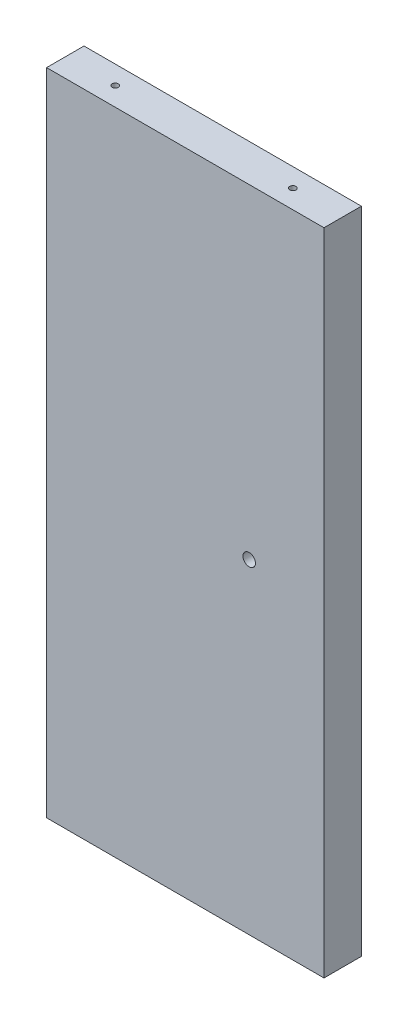
ISO-10303-21;
HEADER;
FILE_DESCRIPTION(('STEP AP214'),'2;1');
FILE_NAME('part.step','',(''),(''),'','','');
FILE_SCHEMA(('AUTOMOTIVE_DESIGN { 1 0 10303 214 1 1 1 1 }'));
ENDSEC;
DATA;
#1=APPLICATION_CONTEXT('core data for automotive mechanical design processes');
#2=APPLICATION_PROTOCOL_DEFINITION('international standard','automotive_design',2000,#1);
#3=PRODUCT_CONTEXT('',#1,'mechanical');
#4=PRODUCT('Part','Part','',(#3));
#5=PRODUCT_RELATED_PRODUCT_CATEGORY('part','',(#4));
#6=PRODUCT_DEFINITION_FORMATION('','',#4);
#7=PRODUCT_DEFINITION_CONTEXT('part definition',#1,'design');
#8=PRODUCT_DEFINITION('design','',#6,#7);
#9=PRODUCT_DEFINITION_SHAPE('','',#8);
#10=(LENGTH_UNIT() NAMED_UNIT(*) SI_UNIT(.MILLI.,.METRE.));
#11=(NAMED_UNIT(*) PLANE_ANGLE_UNIT() SI_UNIT($,.RADIAN.));
#12=(NAMED_UNIT(*) SI_UNIT($,.STERADIAN.) SOLID_ANGLE_UNIT());
#13=UNCERTAINTY_MEASURE_WITH_UNIT(LENGTH_MEASURE(1.E-05),#10,'distance_accuracy_value','');
#14=(GEOMETRIC_REPRESENTATION_CONTEXT(3) GLOBAL_UNCERTAINTY_ASSIGNED_CONTEXT((#13)) GLOBAL_UNIT_ASSIGNED_CONTEXT((#10,
#11,#12)) REPRESENTATION_CONTEXT('',''));
#15=CARTESIAN_POINT('',(0.,0.,0.));
#16=DIRECTION('',(0.,0.,1.));
#17=DIRECTION('',(1.,0.,0.));
#18=AXIS2_PLACEMENT_3D('',#15,#16,#17);
#19=CARTESIAN_POINT('',(209.352967180639,93.4499999969914,19.0499999999996));
#20=DIRECTION('',(1.,0.,0.));
#21=DIRECTION('',(0.,1.,0.));
#22=AXIS2_PLACEMENT_3D('',#19,#20,#21);
#23=PLANE('',#22);
#24=CARTESIAN_POINT('',(209.352967180642,-72.0249999970058,9.52500000000056));
#25=DIRECTION('',(1.,0.,0.));
#26=DIRECTION('',(0.,1.,0.));
#27=AXIS2_PLACEMENT_3D('',#24,#25,#26);
#28=CIRCLE('',#27,1.5875);
#29=CARTESIAN_POINT('',(209.352967180642,-70.4374999970058,9.52500000000056));
#30=VERTEX_POINT('',#29);
#31=EDGE_CURVE('E126',#30,#30,#28,.T.);
#32=ORIENTED_EDGE('',*,*,#31,.T.);
#33=EDGE_LOOP('',(#32));
#34=FACE_BOUND('',#33,.T.);
#35=CARTESIAN_POINT('',(209.352967180643,-154.762499994009,9.5249999999999));
#36=DIRECTION('',(1.,0.,0.));
#37=DIRECTION('',(0.,1.,0.));
#38=AXIS2_PLACEMENT_3D('',#35,#36,#37);
#39=CIRCLE('',#38,1.58749999999999);
#40=CARTESIAN_POINT('',(209.352967180643,-153.174999994009,9.5249999999999));
#41=VERTEX_POINT('',#40);
#42=EDGE_CURVE('E130',#41,#41,#39,.T.);
#43=ORIENTED_EDGE('',*,*,#42,.T.);
#44=EDGE_LOOP('',(#43));
#45=FACE_BOUND('',#44,.T.);
#46=CARTESIAN_POINT('',(209.352967180642,10.7124999999833,9.52500000000145));
#47=DIRECTION('',(1.,0.,0.));
#48=DIRECTION('',(0.,1.,0.));
#49=AXIS2_PLACEMENT_3D('',#46,#47,#48);
#50=CIRCLE('',#49,1.5875);
#51=CARTESIAN_POINT('',(209.352967180642,12.2999999999833,9.52500000000145));
#52=VERTEX_POINT('',#51);
#53=EDGE_CURVE('E134',#52,#52,#50,.T.);
#54=ORIENTED_EDGE('',*,*,#53,.T.);
#55=EDGE_LOOP('',(#54));
#56=FACE_BOUND('',#55,.T.);
#57=DIRECTION('',(0.,-1.,0.));
#58=VECTOR('',#57,1.);
#59=CARTESIAN_POINT('',(209.352967180639,93.4499999969935,-1.11022302462516E-13));
#60=LINE('',#59,#58);
#61=CARTESIAN_POINT('',(209.352967180639,93.4499999969935,-1.11022302462516E-13));
#62=VERTEX_POINT('',#61);
#63=CARTESIAN_POINT('',(209.352967180646,-237.499999991006,1.4432899320127E-12));
#64=VERTEX_POINT('',#63);
#65=EDGE_CURVE('E142',#62,#64,#60,.T.);
#66=ORIENTED_EDGE('',*,*,#65,.T.);
#67=DIRECTION('',(0.,0.,-1.));
#68=VECTOR('',#67,1.);
#69=CARTESIAN_POINT('',(209.352967180647,-237.499999991008,19.0500000000026));
#70=LINE('',#69,#68);
#71=CARTESIAN_POINT('',(209.352967180647,-237.499999991008,19.0500000000026));
#72=VERTEX_POINT('',#71);
#73=EDGE_CURVE('E11',#72,#64,#70,.T.);
#74=ORIENTED_EDGE('',*,*,#73,.F.);
#75=DIRECTION('',(0.,-1.,0.));
#76=VECTOR('',#75,1.);
#77=CARTESIAN_POINT('',(209.352967180639,93.4499999969914,19.0499999999996));
#78=LINE('',#77,#76);
#79=CARTESIAN_POINT('',(209.352967180639,93.4499999969914,19.0499999999996));
#80=VERTEX_POINT('',#79);
#81=EDGE_CURVE('E135',#80,#72,#78,.T.);
#82=ORIENTED_EDGE('',*,*,#81,.F.);
#83=DIRECTION('',(0.,0.,-1.));
#84=VECTOR('',#83,1.);
#85=CARTESIAN_POINT('',(209.352967180639,93.4499999969914,19.0499999999996));
#86=LINE('',#85,#84);
#87=EDGE_CURVE('E141',#80,#62,#86,.T.);
#88=ORIENTED_EDGE('',*,*,#87,.T.);
#89=EDGE_LOOP('',(#66,#74,#82,#88));
#90=FACE_BOUND('',#89,.T.);
#91=ADVANCED_FACE('F36',(#34,#45,#56,#90),#23,.F.);
#92=CARTESIAN_POINT('',(209.352967180647,-237.499999991008,19.0500000000026));
#93=DIRECTION('',(0.,1.,0.));
#94=DIRECTION('',(0.,0.,1.));
#95=AXIS2_PLACEMENT_3D('',#92,#93,#94);
#96=PLANE('',#95);
#97=DIRECTION('',(1.,0.,0.));
#98=VECTOR('',#97,1.);
#99=CARTESIAN_POINT('',(209.352967180646,-237.499999991006,1.4432899320127E-12));
#100=LINE('',#99,#98);
#101=CARTESIAN_POINT('',(350.640829294267,-237.499999991006,2.1094237467878E-12));
#102=VERTEX_POINT('',#101);
#103=EDGE_CURVE('E145',#64,#102,#100,.T.);
#104=ORIENTED_EDGE('',*,*,#103,.T.);
#105=DIRECTION('',(0.,0.,-1.));
#106=VECTOR('',#105,1.);
#107=CARTESIAN_POINT('',(350.640829294267,-237.499999991007,19.0500000000026));
#108=LINE('',#107,#106);
#109=CARTESIAN_POINT('',(350.640829294267,-237.499999991007,19.0500000000026));
#110=VERTEX_POINT('',#109);
#111=EDGE_CURVE('E45',#110,#102,#108,.T.);
#112=ORIENTED_EDGE('',*,*,#111,.F.);
#113=DIRECTION('',(1.,0.,0.));
#114=VECTOR('',#113,1.);
#115=CARTESIAN_POINT('',(209.352967180647,-237.499999991008,19.0500000000026));
#116=LINE('',#115,#114);
#117=EDGE_CURVE('E85',#72,#110,#116,.T.);
#118=ORIENTED_EDGE('',*,*,#117,.F.);
#119=ORIENTED_EDGE('',*,*,#73,.T.);
#120=EDGE_LOOP('',(#104,#112,#118,#119));
#121=FACE_BOUND('',#120,.T.);
#122=ADVANCED_FACE('F180',(#121),#96,.F.);
#123=CARTESIAN_POINT('',(350.640829294266,93.4499999969923,19.0499999999999));
#124=DIRECTION('',(-0.999999999999998,0.,0.));
#125=DIRECTION('',(0.,-1.,0.));
#126=AXIS2_PLACEMENT_3D('',#123,#124,#125);
#127=PLANE('',#126);
#128=DIRECTION('',(0.,1.,0.));
#129=VECTOR('',#128,1.);
#130=CARTESIAN_POINT('',(350.640829294267,93.4499999969934,-5.55111512312578E-13));
#131=LINE('',#130,#129);
#132=CARTESIAN_POINT('',(350.640829294267,93.4499999969934,-5.55111512312578E-13));
#133=VERTEX_POINT('',#132);
#134=EDGE_CURVE('E72',#102,#133,#131,.T.);
#135=ORIENTED_EDGE('',*,*,#134,.T.);
#136=DIRECTION('',(0.,0.,-1.));
#137=VECTOR('',#136,1.);
#138=CARTESIAN_POINT('',(350.640829294266,93.4499999969923,19.0499999999999));
#139=LINE('',#138,#137);
#140=CARTESIAN_POINT('',(350.640829294266,93.4499999969923,19.0499999999999));
#141=VERTEX_POINT('',#140);
#142=EDGE_CURVE('E150',#141,#133,#139,.T.);
#143=ORIENTED_EDGE('',*,*,#142,.F.);
#144=DIRECTION('',(0.,1.,0.));
#145=VECTOR('',#144,1.);
#146=CARTESIAN_POINT('',(350.640829294266,93.4499999969923,19.0499999999999));
#147=LINE('',#146,#145);
#148=EDGE_CURVE('E138',#110,#141,#147,.T.);
#149=ORIENTED_EDGE('',*,*,#148,.F.);
#150=ORIENTED_EDGE('',*,*,#111,.T.);
#151=EDGE_LOOP('',(#135,#143,#149,#150));
#152=FACE_BOUND('',#151,.T.);
#153=ADVANCED_FACE('F185',(#152),#127,.F.);
#154=CARTESIAN_POINT('',(209.352967180639,93.4499999969914,19.0499999999996));
#155=DIRECTION('',(0.,-1.,0.));
#156=DIRECTION('',(0.,0.,-1.));
#157=AXIS2_PLACEMENT_3D('',#154,#155,#156);
#158=PLANE('',#157);
#159=CARTESIAN_POINT('',(325.240829294253,93.4499999969935,9.52499999999967));
#160=DIRECTION('',(0.,-1.,0.));
#161=DIRECTION('',(0.,0.,-1.));
#162=AXIS2_PLACEMENT_3D('',#159,#160,#161);
#163=CIRCLE('',#162,1.58750000000002);
#164=CARTESIAN_POINT('',(325.240829294253,93.4499999969935,7.93749999999965));
#165=VERTEX_POINT('',#164);
#166=EDGE_CURVE('E39',#165,#165,#163,.T.);
#167=ORIENTED_EDGE('',*,*,#166,.T.);
#168=EDGE_LOOP('',(#167));
#169=FACE_BOUND('',#168,.T.);
#170=CARTESIAN_POINT('',(234.752967180639,93.4499999969935,9.5249999999999));
#171=DIRECTION('',(0.,-1.,0.));
#172=DIRECTION('',(0.,0.,-1.));
#173=AXIS2_PLACEMENT_3D('',#170,#171,#172);
#174=CIRCLE('',#173,1.58749999999999);
#175=CARTESIAN_POINT('',(234.752967180639,93.4499999969935,7.9374999999999));
#176=VERTEX_POINT('',#175);
#177=EDGE_CURVE('E122',#176,#176,#174,.T.);
#178=ORIENTED_EDGE('',*,*,#177,.T.);
#179=EDGE_LOOP('',(#178));
#180=FACE_BOUND('',#179,.T.);
#181=DIRECTION('',(-1.,0.,0.));
#182=VECTOR('',#181,1.);
#183=CARTESIAN_POINT('',(209.352967180639,93.4499999969935,-1.11022302462516E-13));
#184=LINE('',#183,#182);
#185=EDGE_CURVE('E78',#133,#62,#184,.T.);
#186=ORIENTED_EDGE('',*,*,#185,.T.);
#187=ORIENTED_EDGE('',*,*,#87,.F.);
#188=DIRECTION('',(-1.,0.,0.));
#189=VECTOR('',#188,1.);
#190=CARTESIAN_POINT('',(209.352967180639,93.4499999969914,19.0499999999996));
#191=LINE('',#190,#189);
#192=EDGE_CURVE('E54',#141,#80,#191,.T.);
#193=ORIENTED_EDGE('',*,*,#192,.F.);
#194=ORIENTED_EDGE('',*,*,#142,.T.);
#195=EDGE_LOOP('',(#186,#187,#193,#194));
#196=FACE_BOUND('',#195,.T.);
#197=ADVANCED_FACE('F161',(#169,#180,#196),#158,.F.);
#198=CARTESIAN_POINT('',(0.,-5.41233724504764E-13,19.0500000000001));
#199=DIRECTION('',(0.,0.,1.));
#200=DIRECTION('',(1.,0.,0.));
#201=AXIS2_PLACEMENT_3D('',#198,#199,#200);
#202=PLANE('',#201);
#203=CARTESIAN_POINT('',(312.540829294264,-72.0249999970022,19.0499999999999));
#204=DIRECTION('',(0.,0.,-1.));
#205=DIRECTION('',(-1.,0.,0.));
#206=AXIS2_PLACEMENT_3D('',#203,#204,#205);
#207=CIRCLE('',#206,3.17499999999993);
#208=CARTESIAN_POINT('',(309.365829294264,-72.0249999970022,19.0499999999999));
#209=VERTEX_POINT('',#208);
#210=EDGE_CURVE('E111',#209,#209,#207,.T.);
#211=ORIENTED_EDGE('',*,*,#210,.T.);
#212=EDGE_LOOP('',(#211));
#213=FACE_BOUND('',#212,.T.);
#214=ORIENTED_EDGE('',*,*,#81,.T.);
#215=ORIENTED_EDGE('',*,*,#117,.T.);
#216=ORIENTED_EDGE('',*,*,#148,.T.);
#217=ORIENTED_EDGE('',*,*,#192,.T.);
#218=EDGE_LOOP('',(#214,#215,#216,#217));
#219=FACE_BOUND('',#218,.T.);
#220=ADVANCED_FACE('F198',(#213,#219),#202,.T.);
#221=CARTESIAN_POINT('',(0.,0.,0.));
#222=DIRECTION('',(0.,0.,1.));
#223=DIRECTION('',(1.,0.,0.));
#224=AXIS2_PLACEMENT_3D('',#221,#222,#223);
#225=PLANE('',#224);
#226=CARTESIAN_POINT('',(312.540829294265,-72.0249999970018,-1.11022302462516E-13));
#227=DIRECTION('',(0.,0.,-1.));
#228=DIRECTION('',(-1.,0.,0.));
#229=AXIS2_PLACEMENT_3D('',#226,#227,#228);
#230=CIRCLE('',#229,3.17499999999993);
#231=CARTESIAN_POINT('',(309.365829294265,-72.0249999970018,-1.08378583885127E-13));
#232=VERTEX_POINT('',#231);
#233=EDGE_CURVE('E116',#232,#232,#230,.T.);
#234=ORIENTED_EDGE('',*,*,#233,.F.);
#235=EDGE_LOOP('',(#234));
#236=FACE_BOUND('',#235,.T.);
#237=ORIENTED_EDGE('',*,*,#65,.F.);
#238=ORIENTED_EDGE('',*,*,#185,.F.);
#239=ORIENTED_EDGE('',*,*,#134,.F.);
#240=ORIENTED_EDGE('',*,*,#103,.F.);
#241=EDGE_LOOP('',(#237,#238,#239,#240));
#242=FACE_BOUND('',#241,.T.);
#243=ADVANCED_FACE('F196',(#236,#242),#225,.F.);
#244=CARTESIAN_POINT('',(196.652967180634,10.7124999999829,9.52500000000012));
#245=DIRECTION('',(-1.,0.,0.));
#246=DIRECTION('',(0.,0.,1.));
#247=AXIS2_PLACEMENT_3D('',#244,#245,#246);
#248=CYLINDRICAL_SURFACE('',#247,1.5875);
#249=CARTESIAN_POINT('',(228.402967180635,10.7124999999828,9.52500000000056));
#250=DIRECTION('',(-1.,0.,0.));
#251=DIRECTION('',(0.,0.,1.));
#252=AXIS2_PLACEMENT_3D('',#249,#250,#251);
#253=CIRCLE('',#252,1.5875);
#254=CARTESIAN_POINT('',(228.402967180635,10.7124999999828,11.1125000000006));
#255=VERTEX_POINT('',#254);
#256=EDGE_CURVE('E131',#255,#255,#253,.T.);
#257=ORIENTED_EDGE('',*,*,#256,.F.);
#258=EDGE_LOOP('',(#257));
#259=FACE_BOUND('',#258,.T.);
#260=ORIENTED_EDGE('',*,*,#53,.F.);
#261=EDGE_LOOP('',(#260));
#262=FACE_BOUND('',#261,.T.);
#263=ADVANCED_FACE('F206',(#259,#262),#248,.F.);
#264=CARTESIAN_POINT('',(228.402967180635,10.7124999999828,9.52500000000056));
#265=DIRECTION('',(-1.,0.,0.));
#266=DIRECTION('',(0.,0.,1.));
#267=AXIS2_PLACEMENT_3D('',#264,#265,#266);
#268=CONICAL_SURFACE('',#267,1.5875,1.02974425867666);
#269=CARTESIAN_POINT('',(229.356833413341,10.7124999999828,9.52500000000178));
#270=VERTEX_POINT('',#269);
#271=VERTEX_LOOP('',#270);
#272=FACE_BOUND('',#271,.T.);
#273=ORIENTED_EDGE('',*,*,#256,.T.);
#274=EDGE_LOOP('',(#273));
#275=FACE_BOUND('',#274,.T.);
#276=ADVANCED_FACE('F212',(#272,#275),#268,.F.);
#277=CARTESIAN_POINT('',(196.652967180635,-154.762499994009,9.5249999999999));
#278=DIRECTION('',(-1.,0.,0.));
#279=DIRECTION('',(0.,0.,1.));
#280=AXIS2_PLACEMENT_3D('',#277,#278,#279);
#281=CYLINDRICAL_SURFACE('',#280,1.58749999999999);
#282=CARTESIAN_POINT('',(228.402967180636,-154.762499994009,9.52499999999878));
#283=DIRECTION('',(-1.,0.,0.));
#284=DIRECTION('',(0.,0.,1.));
#285=AXIS2_PLACEMENT_3D('',#282,#283,#284);
#286=CIRCLE('',#285,1.58749999999999);
#287=CARTESIAN_POINT('',(228.402967180636,-154.762499994009,11.1124999999988));
#288=VERTEX_POINT('',#287);
#289=EDGE_CURVE('E127',#288,#288,#286,.T.);
#290=ORIENTED_EDGE('',*,*,#289,.F.);
#291=EDGE_LOOP('',(#290));
#292=FACE_BOUND('',#291,.T.);
#293=ORIENTED_EDGE('',*,*,#42,.F.);
#294=EDGE_LOOP('',(#293));
#295=FACE_BOUND('',#294,.T.);
#296=ADVANCED_FACE('F253',(#292,#295),#281,.F.);
#297=CARTESIAN_POINT('',(228.402967180636,-154.762499994009,9.52499999999878));
#298=DIRECTION('',(-1.,0.,0.));
#299=DIRECTION('',(0.,0.,1.));
#300=AXIS2_PLACEMENT_3D('',#297,#298,#299);
#301=CONICAL_SURFACE('',#300,1.58749999999999,1.02974425867666);
#302=CARTESIAN_POINT('',(229.356833413341,-154.762499994009,9.52499999999901));
#303=VERTEX_POINT('',#302);
#304=VERTEX_LOOP('',#303);
#305=FACE_BOUND('',#304,.T.);
#306=ORIENTED_EDGE('',*,*,#289,.T.);
#307=EDGE_LOOP('',(#306));
#308=FACE_BOUND('',#307,.T.);
#309=ADVANCED_FACE('F262',(#305,#308),#301,.F.);
#310=CARTESIAN_POINT('',(196.652967180635,-72.0249999970058,9.52500000000023));
#311=DIRECTION('',(-1.,0.,0.));
#312=DIRECTION('',(0.,0.,1.));
#313=AXIS2_PLACEMENT_3D('',#310,#311,#312);
#314=CYLINDRICAL_SURFACE('',#313,1.5875);
#315=CARTESIAN_POINT('',(228.402967180634,-72.0249999970049,9.52499999999945));
#316=DIRECTION('',(-1.,0.,0.));
#317=DIRECTION('',(0.,0.,1.));
#318=AXIS2_PLACEMENT_3D('',#315,#316,#317);
#319=CIRCLE('',#318,1.58749999999999);
#320=CARTESIAN_POINT('',(228.402967180634,-72.0249999970049,11.1124999999994));
#321=VERTEX_POINT('',#320);
#322=EDGE_CURVE('E123',#321,#321,#319,.T.);
#323=ORIENTED_EDGE('',*,*,#322,.F.);
#324=EDGE_LOOP('',(#323));
#325=FACE_BOUND('',#324,.T.);
#326=ORIENTED_EDGE('',*,*,#31,.F.);
#327=EDGE_LOOP('',(#326));
#328=FACE_BOUND('',#327,.T.);
#329=ADVANCED_FACE('F175',(#325,#328),#314,.F.);
#330=CARTESIAN_POINT('',(228.402967180634,-72.0249999970049,9.52499999999945));
#331=DIRECTION('',(-1.,0.,0.));
#332=DIRECTION('',(0.,0.,1.));
#333=AXIS2_PLACEMENT_3D('',#330,#331,#332);
#334=CONICAL_SURFACE('',#333,1.58749999999999,1.02974425867666);
#335=CARTESIAN_POINT('',(229.356833413341,-72.0249999970056,9.5249999999999));
#336=VERTEX_POINT('',#335);
#337=VERTEX_LOOP('',#336);
#338=FACE_BOUND('',#337,.T.);
#339=ORIENTED_EDGE('',*,*,#322,.T.);
#340=EDGE_LOOP('',(#339));
#341=FACE_BOUND('',#340,.T.);
#342=ADVANCED_FACE('F166',(#338,#341),#334,.F.);
#343=CARTESIAN_POINT('',(234.752967180639,112.499999996992,9.52499999999967));
#344=DIRECTION('',(0.,1.,0.));
#345=DIRECTION('',(0.,0.,1.));
#346=AXIS2_PLACEMENT_3D('',#343,#344,#345);
#347=CYLINDRICAL_SURFACE('',#346,1.58749999999999);
#348=CARTESIAN_POINT('',(234.752967180639,74.399999996992,9.52500000000034));
#349=DIRECTION('',(0.,1.,0.));
#350=DIRECTION('',(0.,0.,1.));
#351=AXIS2_PLACEMENT_3D('',#348,#349,#350);
#352=CIRCLE('',#351,1.58749999999999);
#353=CARTESIAN_POINT('',(234.752967180639,74.399999996992,11.1125000000003));
#354=VERTEX_POINT('',#353);
#355=EDGE_CURVE('E114',#354,#354,#352,.T.);
#356=ORIENTED_EDGE('',*,*,#355,.F.);
#357=EDGE_LOOP('',(#356));
#358=FACE_BOUND('',#357,.T.);
#359=ORIENTED_EDGE('',*,*,#177,.F.);
#360=EDGE_LOOP('',(#359));
#361=FACE_BOUND('',#360,.T.);
#362=ADVANCED_FACE('F163',(#358,#361),#347,.F.);
#363=CARTESIAN_POINT('',(234.752967180639,74.399999996992,9.52500000000034));
#364=DIRECTION('',(0.,1.,0.));
#365=DIRECTION('',(0.,0.,1.));
#366=AXIS2_PLACEMENT_3D('',#363,#364,#365);
#367=CONICAL_SURFACE('',#366,1.58749999999999,1.02974425867665);
#368=CARTESIAN_POINT('',(234.752967180639,73.4461337642861,9.52500000000045));
#369=VERTEX_POINT('',#368);
#370=VERTEX_LOOP('',#369);
#371=FACE_BOUND('',#370,.T.);
#372=ORIENTED_EDGE('',*,*,#355,.T.);
#373=EDGE_LOOP('',(#372));
#374=FACE_BOUND('',#373,.T.);
#375=ADVANCED_FACE('F165',(#371,#374),#367,.F.);
#376=CARTESIAN_POINT('',(325.240829294253,112.499999996992,9.52499999999934));
#377=DIRECTION('',(0.,1.,0.));
#378=DIRECTION('',(0.,0.,1.));
#379=AXIS2_PLACEMENT_3D('',#376,#377,#378);
#380=CYLINDRICAL_SURFACE('',#379,1.58750000000002);
#381=CARTESIAN_POINT('',(325.240829294253,74.399999996992,9.52500000000012));
#382=DIRECTION('',(0.,1.,0.));
#383=DIRECTION('',(0.,0.,1.));
#384=AXIS2_PLACEMENT_3D('',#381,#382,#383);
#385=CIRCLE('',#384,1.58750000000002);
#386=CARTESIAN_POINT('',(325.240829294253,74.399999996992,11.1125000000001));
#387=VERTEX_POINT('',#386);
#388=EDGE_CURVE('E109',#387,#387,#385,.T.);
#389=ORIENTED_EDGE('',*,*,#388,.F.);
#390=EDGE_LOOP('',(#389));
#391=FACE_BOUND('',#390,.T.);
#392=ORIENTED_EDGE('',*,*,#166,.F.);
#393=EDGE_LOOP('',(#392));
#394=FACE_BOUND('',#393,.T.);
#395=ADVANCED_FACE('F105',(#391,#394),#380,.F.);
#396=CARTESIAN_POINT('',(325.240829294253,74.399999996992,9.52500000000012));
#397=DIRECTION('',(0.,1.,0.));
#398=DIRECTION('',(0.,0.,1.));
#399=AXIS2_PLACEMENT_3D('',#396,#397,#398);
#400=CONICAL_SURFACE('',#399,1.58750000000002,1.02974425867666);
#401=CARTESIAN_POINT('',(325.240829294253,73.4461337642858,9.52500000000023));
#402=VERTEX_POINT('',#401);
#403=VERTEX_LOOP('',#402);
#404=FACE_BOUND('',#403,.T.);
#405=ORIENTED_EDGE('',*,*,#388,.T.);
#406=EDGE_LOOP('',(#405));
#407=FACE_BOUND('',#406,.T.);
#408=ADVANCED_FACE('F101',(#404,#407),#400,.F.);
#409=CARTESIAN_POINT('',(312.540829294265,-72.0249999970018,-1.11022302462516E-13));
#410=DIRECTION('',(0.,0.,-1.));
#411=DIRECTION('',(-1.,0.,0.));
#412=AXIS2_PLACEMENT_3D('',#409,#410,#411);
#413=CYLINDRICAL_SURFACE('',#412,3.17499999999993);
#414=ORIENTED_EDGE('',*,*,#210,.F.);
#415=EDGE_LOOP('',(#414));
#416=FACE_BOUND('',#415,.T.);
#417=ORIENTED_EDGE('',*,*,#233,.T.);
#418=EDGE_LOOP('',(#417));
#419=FACE_BOUND('',#418,.T.);
#420=ADVANCED_FACE('F104',(#416,#419),#413,.F.);
#421=CLOSED_SHELL('',(#91,#122,#153,#197,#220,#243,#263,#276,#296,#309,#329,#342,#362,#375,#395,
#408,#420));
#422=MANIFOLD_SOLID_BREP('B2',#421);
#423=ADVANCED_BREP_SHAPE_REPRESENTATION('',(#18,#422),#14);
#424=SHAPE_DEFINITION_REPRESENTATION(#9,#423);
ENDSEC;
END-ISO-10303-21;
